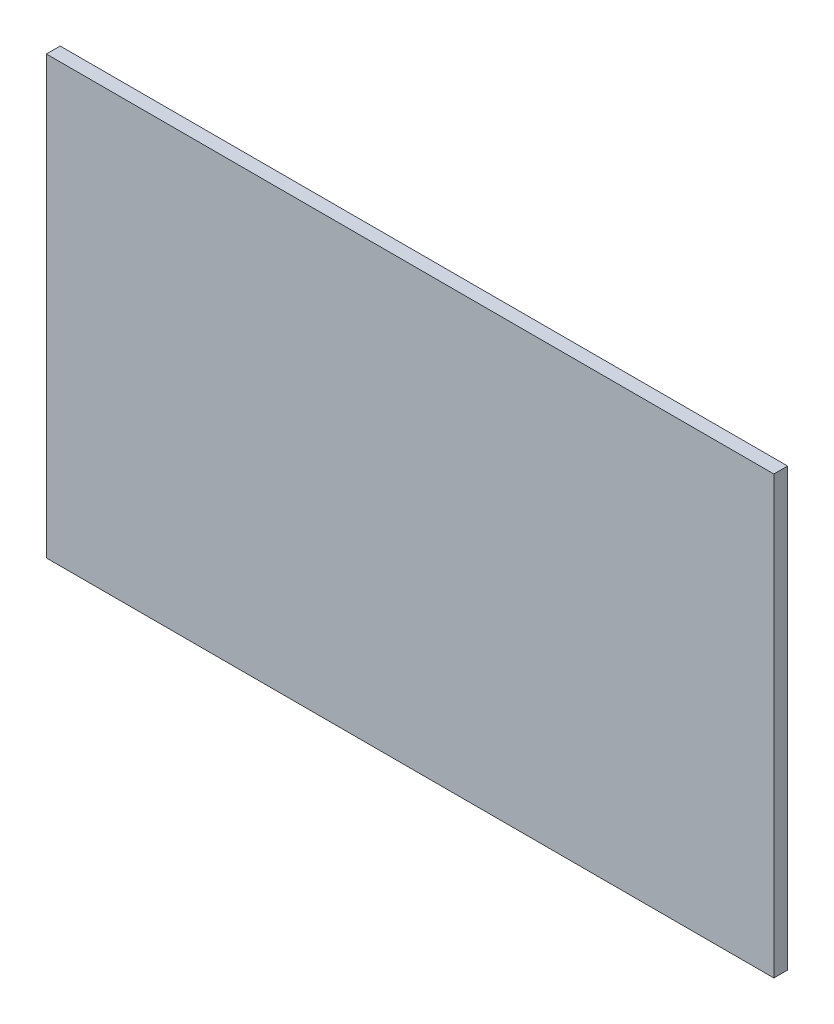
ISO-10303-21;
HEADER;
FILE_DESCRIPTION(('STEP AP214'),'2;1');
FILE_NAME('part.step','',(''),(''),'','','');
FILE_SCHEMA(('AUTOMOTIVE_DESIGN { 1 0 10303 214 1 1 1 1 }'));
ENDSEC;
DATA;
#1=APPLICATION_CONTEXT('core data for automotive mechanical design processes');
#2=APPLICATION_PROTOCOL_DEFINITION('international standard','automotive_design',2000,#1);
#3=PRODUCT_CONTEXT('',#1,'mechanical');
#4=PRODUCT('Part','Part','',(#3));
#5=PRODUCT_RELATED_PRODUCT_CATEGORY('part','',(#4));
#6=PRODUCT_DEFINITION_FORMATION('','',#4);
#7=PRODUCT_DEFINITION_CONTEXT('part definition',#1,'design');
#8=PRODUCT_DEFINITION('design','',#6,#7);
#9=PRODUCT_DEFINITION_SHAPE('','',#8);
#10=(LENGTH_UNIT() NAMED_UNIT(*) SI_UNIT(.MILLI.,.METRE.));
#11=(NAMED_UNIT(*) PLANE_ANGLE_UNIT() SI_UNIT($,.RADIAN.));
#12=(NAMED_UNIT(*) SI_UNIT($,.STERADIAN.) SOLID_ANGLE_UNIT());
#13=UNCERTAINTY_MEASURE_WITH_UNIT(LENGTH_MEASURE(1.E-05),#10,'distance_accuracy_value','');
#14=(GEOMETRIC_REPRESENTATION_CONTEXT(3) GLOBAL_UNCERTAINTY_ASSIGNED_CONTEXT((#13)) GLOBAL_UNIT_ASSIGNED_CONTEXT((#10,
#11,#12)) REPRESENTATION_CONTEXT('',''));
#15=CARTESIAN_POINT('',(0.,0.,0.));
#16=DIRECTION('',(0.,0.,1.));
#17=DIRECTION('',(1.,0.,0.));
#18=AXIS2_PLACEMENT_3D('',#15,#16,#17);
#19=CARTESIAN_POINT('',(-66.0086980920406,33.0866668623942,-1.89738));
#20=DIRECTION('',(-1.,0.,0.));
#21=DIRECTION('',(0.,0.,1.));
#22=AXIS2_PLACEMENT_3D('',#19,#20,#21);
#23=PLANE('',#22);
#24=DIRECTION('',(0.,-1.,0.));
#25=VECTOR('',#24,1.);
#26=CARTESIAN_POINT('',(-66.0086980920406,33.0866668623942,0.));
#27=LINE('',#26,#25);
#28=CARTESIAN_POINT('',(-66.0086980920406,33.0866668623942,0.));
#29=VERTEX_POINT('',#28);
#30=CARTESIAN_POINT('',(-66.0086980920406,-26.9133331376058,0.));
#31=VERTEX_POINT('',#30);
#32=EDGE_CURVE('E100',#29,#31,#27,.T.);
#33=ORIENTED_EDGE('',*,*,#32,.F.);
#34=DIRECTION('',(0.,0.,1.));
#35=VECTOR('',#34,1.);
#36=CARTESIAN_POINT('',(-66.0086980920406,33.0866668623942,-1.89738));
#37=LINE('',#36,#35);
#38=CARTESIAN_POINT('',(-66.0086980920406,33.0866668623942,-1.89738));
#39=VERTEX_POINT('',#38);
#40=EDGE_CURVE('E11',#39,#29,#37,.T.);
#41=ORIENTED_EDGE('',*,*,#40,.F.);
#42=DIRECTION('',(0.,-1.,0.));
#43=VECTOR('',#42,1.);
#44=CARTESIAN_POINT('',(-66.0086980920406,33.0866668623942,-1.89738));
#45=LINE('',#44,#43);
#46=CARTESIAN_POINT('',(-66.0086980920406,-26.9133331376058,-1.89738));
#47=VERTEX_POINT('',#46);
#48=EDGE_CURVE('E94',#39,#47,#45,.T.);
#49=ORIENTED_EDGE('',*,*,#48,.T.);
#50=DIRECTION('',(0.,0.,1.));
#51=VECTOR('',#50,1.);
#52=CARTESIAN_POINT('',(-66.0086980920406,-26.9133331376058,-1.89738));
#53=LINE('',#52,#51);
#54=EDGE_CURVE('E39',#47,#31,#53,.T.);
#55=ORIENTED_EDGE('',*,*,#54,.T.);
#56=EDGE_LOOP('',(#33,#41,#49,#55));
#57=FACE_BOUND('',#56,.T.);
#58=ADVANCED_FACE('F36',(#57),#23,.T.);
#59=CARTESIAN_POINT('',(-66.0086980920406,33.0866668623942,-1.89738));
#60=DIRECTION('',(0.,1.,0.));
#61=DIRECTION('',(0.,0.,1.));
#62=AXIS2_PLACEMENT_3D('',#59,#60,#61);
#63=PLANE('',#62);
#64=DIRECTION('',(-1.,0.,0.));
#65=VECTOR('',#64,1.);
#66=CARTESIAN_POINT('',(-66.0086980920406,33.0866668623942,0.));
#67=LINE('',#66,#65);
#68=CARTESIAN_POINT('',(33.9913019079594,33.0866668623942,0.));
#69=VERTEX_POINT('',#68);
#70=EDGE_CURVE('E96',#69,#29,#67,.T.);
#71=ORIENTED_EDGE('',*,*,#70,.F.);
#72=DIRECTION('',(0.,0.,1.));
#73=VECTOR('',#72,1.);
#74=CARTESIAN_POINT('',(33.9913019079594,33.0866668623942,-1.89738));
#75=LINE('',#74,#73);
#76=CARTESIAN_POINT('',(33.9913019079594,33.0866668623942,-1.89738));
#77=VERTEX_POINT('',#76);
#78=EDGE_CURVE('E45',#77,#69,#75,.T.);
#79=ORIENTED_EDGE('',*,*,#78,.F.);
#80=DIRECTION('',(-1.,0.,0.));
#81=VECTOR('',#80,1.);
#82=CARTESIAN_POINT('',(-66.0086980920406,33.0866668623942,-1.89738));
#83=LINE('',#82,#81);
#84=EDGE_CURVE('E91',#77,#39,#83,.T.);
#85=ORIENTED_EDGE('',*,*,#84,.T.);
#86=ORIENTED_EDGE('',*,*,#40,.T.);
#87=EDGE_LOOP('',(#71,#79,#85,#86));
#88=FACE_BOUND('',#87,.T.);
#89=ADVANCED_FACE('F110',(#88),#63,.T.);
#90=CARTESIAN_POINT('',(33.9913019079594,33.0866668623942,-1.89738));
#91=DIRECTION('',(1.,0.,0.));
#92=DIRECTION('',(0.,0.,-1.));
#93=AXIS2_PLACEMENT_3D('',#90,#91,#92);
#94=PLANE('',#93);
#95=DIRECTION('',(0.,1.,0.));
#96=VECTOR('',#95,1.);
#97=CARTESIAN_POINT('',(33.9913019079594,33.0866668623942,0.));
#98=LINE('',#97,#96);
#99=CARTESIAN_POINT('',(33.9913019079594,-26.9133331376058,0.));
#100=VERTEX_POINT('',#99);
#101=EDGE_CURVE('E86',#100,#69,#98,.T.);
#102=ORIENTED_EDGE('',*,*,#101,.F.);
#103=DIRECTION('',(0.,0.,1.));
#104=VECTOR('',#103,1.);
#105=CARTESIAN_POINT('',(33.9913019079594,-26.9133331376058,-1.89738));
#106=LINE('',#105,#104);
#107=CARTESIAN_POINT('',(33.9913019079594,-26.9133331376058,-1.89738));
#108=VERTEX_POINT('',#107);
#109=EDGE_CURVE('E81',#108,#100,#106,.T.);
#110=ORIENTED_EDGE('',*,*,#109,.F.);
#111=DIRECTION('',(0.,1.,0.));
#112=VECTOR('',#111,1.);
#113=CARTESIAN_POINT('',(33.9913019079594,33.0866668623942,-1.89738));
#114=LINE('',#113,#112);
#115=EDGE_CURVE('E84',#108,#77,#114,.T.);
#116=ORIENTED_EDGE('',*,*,#115,.T.);
#117=ORIENTED_EDGE('',*,*,#78,.T.);
#118=EDGE_LOOP('',(#102,#110,#116,#117));
#119=FACE_BOUND('',#118,.T.);
#120=ADVANCED_FACE('F83',(#119),#94,.T.);
#121=CARTESIAN_POINT('',(-66.0086980920406,-26.9133331376058,-1.89738));
#122=DIRECTION('',(0.,-1.,0.));
#123=DIRECTION('',(0.,0.,-1.));
#124=AXIS2_PLACEMENT_3D('',#121,#122,#123);
#125=PLANE('',#124);
#126=DIRECTION('',(1.,0.,0.));
#127=VECTOR('',#126,1.);
#128=CARTESIAN_POINT('',(-66.0086980920406,-26.9133331376058,0.));
#129=LINE('',#128,#127);
#130=EDGE_CURVE('E103',#31,#100,#129,.T.);
#131=ORIENTED_EDGE('',*,*,#130,.F.);
#132=ORIENTED_EDGE('',*,*,#54,.F.);
#133=DIRECTION('',(1.,0.,0.));
#134=VECTOR('',#133,1.);
#135=CARTESIAN_POINT('',(-66.0086980920406,-26.9133331376058,-1.89738));
#136=LINE('',#135,#134);
#137=EDGE_CURVE('E90',#47,#108,#136,.T.);
#138=ORIENTED_EDGE('',*,*,#137,.T.);
#139=ORIENTED_EDGE('',*,*,#109,.T.);
#140=EDGE_LOOP('',(#131,#132,#138,#139));
#141=FACE_BOUND('',#140,.T.);
#142=ADVANCED_FACE('F93',(#141),#125,.T.);
#143=CARTESIAN_POINT('',(0.,0.,-1.89738));
#144=DIRECTION('',(0.,0.,1.));
#145=DIRECTION('',(1.,0.,0.));
#146=AXIS2_PLACEMENT_3D('',#143,#144,#145);
#147=PLANE('',#146);
#148=ORIENTED_EDGE('',*,*,#48,.F.);
#149=ORIENTED_EDGE('',*,*,#84,.F.);
#150=ORIENTED_EDGE('',*,*,#115,.F.);
#151=ORIENTED_EDGE('',*,*,#137,.F.);
#152=EDGE_LOOP('',(#148,#149,#150,#151));
#153=FACE_BOUND('',#152,.T.);
#154=ADVANCED_FACE('F89',(#153),#147,.F.);
#155=CARTESIAN_POINT('',(0.,0.,0.));
#156=DIRECTION('',(0.,0.,1.));
#157=DIRECTION('',(1.,0.,0.));
#158=AXIS2_PLACEMENT_3D('',#155,#156,#157);
#159=PLANE('',#158);
#160=ORIENTED_EDGE('',*,*,#32,.T.);
#161=ORIENTED_EDGE('',*,*,#130,.T.);
#162=ORIENTED_EDGE('',*,*,#101,.T.);
#163=ORIENTED_EDGE('',*,*,#70,.T.);
#164=EDGE_LOOP('',(#160,#161,#162,#163));
#165=FACE_BOUND('',#164,.T.);
#166=ADVANCED_FACE('F109',(#165),#159,.T.);
#167=CLOSED_SHELL('',(#58,#89,#120,#142,#154,#166));
#168=MANIFOLD_SOLID_BREP('B2',#167);
#169=ADVANCED_BREP_SHAPE_REPRESENTATION('',(#18,#168),#14);
#170=SHAPE_DEFINITION_REPRESENTATION(#9,#169);
ENDSEC;
END-ISO-10303-21;
